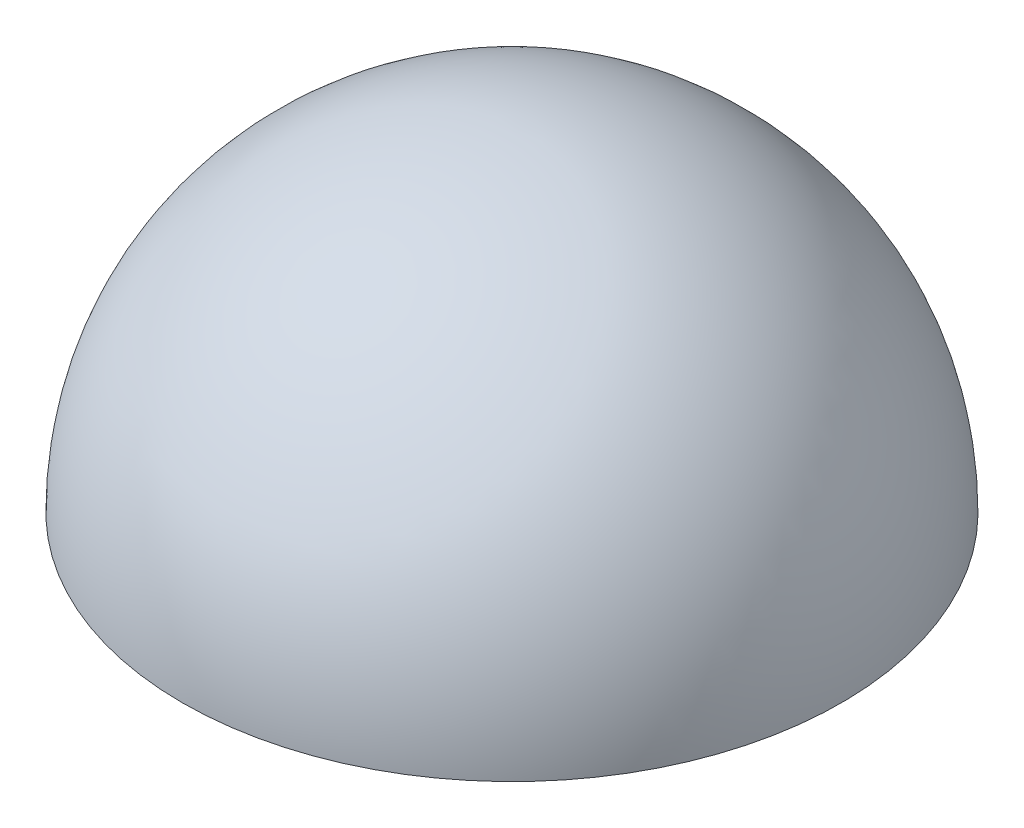
ISO-10303-21;
HEADER;
FILE_DESCRIPTION(('STEP AP214'),'2;1');
FILE_NAME('part.step','',(''),(''),'','','');
FILE_SCHEMA(('AUTOMOTIVE_DESIGN { 1 0 10303 214 1 1 1 1 }'));
ENDSEC;
DATA;
#1=APPLICATION_CONTEXT('core data for automotive mechanical design processes');
#2=APPLICATION_PROTOCOL_DEFINITION('international standard','automotive_design',2000,#1);
#3=PRODUCT_CONTEXT('',#1,'mechanical');
#4=PRODUCT('Part','Part','',(#3));
#5=PRODUCT_RELATED_PRODUCT_CATEGORY('part','',(#4));
#6=PRODUCT_DEFINITION_FORMATION('','',#4);
#7=PRODUCT_DEFINITION_CONTEXT('part definition',#1,'design');
#8=PRODUCT_DEFINITION('design','',#6,#7);
#9=PRODUCT_DEFINITION_SHAPE('','',#8);
#10=(LENGTH_UNIT() NAMED_UNIT(*) SI_UNIT(.MILLI.,.METRE.));
#11=(NAMED_UNIT(*) PLANE_ANGLE_UNIT() SI_UNIT($,.RADIAN.));
#12=(NAMED_UNIT(*) SI_UNIT($,.STERADIAN.) SOLID_ANGLE_UNIT());
#13=UNCERTAINTY_MEASURE_WITH_UNIT(LENGTH_MEASURE(1.E-05),#10,'distance_accuracy_value','');
#14=(GEOMETRIC_REPRESENTATION_CONTEXT(3) GLOBAL_UNCERTAINTY_ASSIGNED_CONTEXT((#13)) GLOBAL_UNIT_ASSIGNED_CONTEXT((#10,
#11,#12)) REPRESENTATION_CONTEXT('',''));
#15=CARTESIAN_POINT('',(0.,0.,0.));
#16=DIRECTION('',(0.,0.,1.));
#17=DIRECTION('',(1.,0.,0.));
#18=AXIS2_PLACEMENT_3D('',#15,#16,#17);
#19=CARTESIAN_POINT('',(0.,0.,0.));
#20=DIRECTION('',(0.,0.,-1.));
#21=DIRECTION('',(-1.,0.,0.));
#22=AXIS2_PLACEMENT_3D('',#19,#20,#21);
#23=SPHERICAL_SURFACE('',#22,25.25);
#24=CARTESIAN_POINT('',(0.,0.,0.));
#25=DIRECTION('',(0.,-1.,0.));
#26=DIRECTION('',(0.,0.,1.));
#27=AXIS2_PLACEMENT_3D('',#24,#25,#26);
#28=SPHERICAL_SURFACE('',#27,25.25);
#29=CARTESIAN_POINT('',(0.,0.,0.));
#30=DIRECTION('',(0.,-1.,0.));
#31=DIRECTION('',(0.,0.,1.));
#32=AXIS2_PLACEMENT_3D('',#29,#30,#31);
#33=CIRCLE('',#32,25.25);
#34=CARTESIAN_POINT('',(0.,0.,25.25));
#35=VERTEX_POINT('',#34);
#36=EDGE_CURVE('E11',#35,#35,#33,.T.);
#37=ORIENTED_EDGE('',*,*,#36,.F.);
#38=EDGE_LOOP('',(#37));
#39=FACE_BOUND('',#38,.T.);
#40=ADVANCED_FACE('F39',(#39),#28,.T.);
#41=CARTESIAN_POINT('',(0.,0.,0.));
#42=DIRECTION('',(0.,-1.,0.));
#43=DIRECTION('',(0.,0.,1.));
#44=AXIS2_PLACEMENT_3D('',#41,#42,#43);
#45=PLANE('',#44);
#46=CARTESIAN_POINT('',(0.,0.,0.));
#47=DIRECTION('',(0.,-1.,0.));
#48=DIRECTION('',(1.,0.,0.));
#49=AXIS2_PLACEMENT_3D('',#46,#47,#48);
#50=CIRCLE('',#49,24.825);
#51=CARTESIAN_POINT('',(-5.13443640124095,0.,24.2882314679684));
#52=VERTEX_POINT('',#51);
#53=CARTESIAN_POINT('',(-23.5585011040672,-1.64508133951932E-13,-7.82800426224105));
#54=VERTEX_POINT('',#53);
#55=EDGE_CURVE('E261',#52,#54,#50,.T.);
#56=ORIENTED_EDGE('',*,*,#55,.F.);
#57=DIRECTION('',(0.206825232678387,0.,-0.978377904047066));
#58=VECTOR('',#57,1.);
#59=CARTESIAN_POINT('',(-5.13443640124095,0.,24.2882314679684));
#60=LINE('',#59,#58);
#61=CARTESIAN_POINT('',(-5.,0.,23.6522858303378));
#62=VERTEX_POINT('',#61);
#63=EDGE_CURVE('E206',#52,#62,#60,.T.);
#64=ORIENTED_EDGE('',*,*,#63,.T.);
#65=CARTESIAN_POINT('',(0.,0.,0.));
#66=DIRECTION('',(0.,1.,0.));
#67=DIRECTION('',(1.,0.,0.));
#68=AXIS2_PLACEMENT_3D('',#65,#66,#67);
#69=CIRCLE('',#68,24.175);
#70=CARTESIAN_POINT('',(5.,0.,23.6522858303378));
#71=VERTEX_POINT('',#70);
#72=EDGE_CURVE('E236',#62,#71,#69,.T.);
#73=ORIENTED_EDGE('',*,*,#72,.T.);
#74=DIRECTION('',(0.,0.,1.));
#75=VECTOR('',#74,1.);
#76=CARTESIAN_POINT('',(5.,0.,23.6522858303378));
#77=LINE('',#76,#75);
#78=CARTESIAN_POINT('',(4.99999999999999,0.,24.3162625623265));
#79=VERTEX_POINT('',#78);
#80=EDGE_CURVE('E220',#71,#79,#77,.T.);
#81=ORIENTED_EDGE('',*,*,#80,.T.);
#82=CARTESIAN_POINT('',(23.6014436648777,1.64808000251356E-13,-7.69756337639399));
#83=VERTEX_POINT('',#82);
#84=EDGE_CURVE('E247',#83,#79,#50,.T.);
#85=ORIENTED_EDGE('',*,*,#84,.F.);
#86=DIRECTION('',(-0.950712735745326,0.,0.310073046380425));
#87=VECTOR('',#86,1.);
#88=CARTESIAN_POINT('',(23.6014436648777,1.64808000251356E-13,-7.69756337639399));
#89=LINE('',#88,#87);
#90=CARTESIAN_POINT('',(22.9834803866433,1.60492785743265E-13,-7.49601589624672));
#91=VERTEX_POINT('',#90);
#92=EDGE_CURVE('E170',#83,#91,#89,.T.);
#93=ORIENTED_EDGE('',*,*,#92,.T.);
#94=CARTESIAN_POINT('',(0.,0.,0.));
#95=DIRECTION('',(0.,1.,0.));
#96=DIRECTION('',(1.,0.,0.));
#97=AXIS2_PLACEMENT_3D('',#94,#95,#96);
#98=CIRCLE('',#97,24.175);
#99=CARTESIAN_POINT('',(17.9834803866433,1.25577972354833E-13,-16.1562699340911));
#100=VERTEX_POINT('',#99);
#101=EDGE_CURVE('E195',#91,#100,#98,.T.);
#102=ORIENTED_EDGE('',*,*,#101,.T.);
#103=DIRECTION('',(0.866025403784441,0.,-0.499999999999996));
#104=VECTOR('',#103,1.);
#105=CARTESIAN_POINT('',(17.9834803866433,1.25577972354834E-13,-16.1562699340911));
#106=LINE('',#105,#104);
#107=CARTESIAN_POINT('',(18.5585011040672,1.29593320563501E-13,-16.4882583000854));
#108=VERTEX_POINT('',#107);
#109=EDGE_CURVE('E179',#100,#108,#106,.T.);
#110=ORIENTED_EDGE('',*,*,#109,.T.);
#111=CARTESIAN_POINT('',(-18.4670072636368,-1.28954422490536E-13,-16.5906680915744));
#112=VERTEX_POINT('',#111);
#113=EDGE_CURVE('E263',#112,#108,#50,.T.);
#114=ORIENTED_EDGE('',*,*,#113,.F.);
#115=DIRECTION('',(0.743887503066944,0.,0.66830485766664));
#116=VECTOR('',#115,1.);
#117=CARTESIAN_POINT('',(-18.4670072636368,-1.28954422490536E-13,-16.5906680915744));
#118=LINE('',#117,#116);
#119=CARTESIAN_POINT('',(-17.9834803866433,-1.25577972354833E-13,-16.1562699340911));
#120=VERTEX_POINT('',#119);
#121=EDGE_CURVE('E160',#112,#120,#118,.T.);
#122=ORIENTED_EDGE('',*,*,#121,.T.);
#123=CARTESIAN_POINT('',(0.,0.,0.));
#124=DIRECTION('',(0.,1.,0.));
#125=DIRECTION('',(1.,0.,0.));
#126=AXIS2_PLACEMENT_3D('',#123,#124,#125);
#127=CIRCLE('',#126,24.175);
#128=CARTESIAN_POINT('',(-22.9834803866433,-1.60492785743264E-13,-7.49601589624673));
#129=VERTEX_POINT('',#128);
#130=EDGE_CURVE('E134',#120,#129,#127,.T.);
#131=ORIENTED_EDGE('',*,*,#130,.T.);
#132=DIRECTION('',(-0.86602540378444,0.,-0.499999999999997));
#133=VECTOR('',#132,1.);
#134=CARTESIAN_POINT('',(-22.9834803866433,-1.60492785743264E-13,-7.49601589624674));
#135=LINE('',#134,#133);
#136=EDGE_CURVE('E155',#129,#54,#135,.T.);
#137=ORIENTED_EDGE('',*,*,#136,.T.);
#138=EDGE_LOOP('',(#56,#64,#73,#81,#85,#93,#102,#110,#114,#122,#131,#137));
#139=FACE_BOUND('',#138,.T.);
#140=ORIENTED_EDGE('',*,*,#36,.T.);
#141=EDGE_LOOP('',(#140));
#142=FACE_BOUND('',#141,.T.);
#143=ADVANCED_FACE('F276',(#139,#142),#45,.T.);
#144=CARTESIAN_POINT('',(0.,2.15,0.));
#145=DIRECTION('',(0.,-1.,0.));
#146=DIRECTION('',(1.,0.,0.));
#147=AXIS2_PLACEMENT_3D('',#144,#145,#146);
#148=CYLINDRICAL_SURFACE('',#147,24.825);
#149=ORIENTED_EDGE('',*,*,#55,.T.);
#150=DIRECTION('',(0.,-1.,0.));
#151=VECTOR('',#150,1.);
#152=CARTESIAN_POINT('',(-23.5585011040672,1.04999999999984,-7.82800426224106));
#153=LINE('',#152,#151);
#154=CARTESIAN_POINT('',(-23.5585011040672,1.04999999999984,-7.82800426224105));
#155=VERTEX_POINT('',#154);
#156=EDGE_CURVE('E55',#155,#54,#153,.T.);
#157=ORIENTED_EDGE('',*,*,#156,.F.);
#158=CARTESIAN_POINT('',(0.,1.05,0.));
#159=DIRECTION('',(0.,-1.,0.));
#160=DIRECTION('',(1.,0.,0.));
#161=AXIS2_PLACEMENT_3D('',#158,#159,#160);
#162=CIRCLE('',#161,24.825);
#163=CARTESIAN_POINT('',(-18.4670072636368,1.04999999999987,-16.5906680915744));
#164=VERTEX_POINT('',#163);
#165=EDGE_CURVE('E59',#155,#164,#162,.T.);
#166=ORIENTED_EDGE('',*,*,#165,.T.);
#167=DIRECTION('',(0.,-1.,0.));
#168=VECTOR('',#167,1.);
#169=CARTESIAN_POINT('',(-18.4670072636368,1.04999999999987,-16.5906680915744));
#170=LINE('',#169,#168);
#171=EDGE_CURVE('E141',#164,#112,#170,.T.);
#172=ORIENTED_EDGE('',*,*,#171,.T.);
#173=ORIENTED_EDGE('',*,*,#113,.T.);
#174=DIRECTION('',(0.,-1.,0.));
#175=VECTOR('',#174,1.);
#176=CARTESIAN_POINT('',(18.5585011040672,1.05000000000013,-16.4882583000854));
#177=LINE('',#176,#175);
#178=CARTESIAN_POINT('',(18.5585011040672,1.05000000000013,-16.4882583000854));
#179=VERTEX_POINT('',#178);
#180=EDGE_CURVE('E202',#179,#108,#177,.T.);
#181=ORIENTED_EDGE('',*,*,#180,.F.);
#182=CARTESIAN_POINT('',(0.,1.05,0.));
#183=DIRECTION('',(0.,-1.,0.));
#184=DIRECTION('',(1.,0.,0.));
#185=AXIS2_PLACEMENT_3D('',#182,#183,#184);
#186=CIRCLE('',#185,24.825);
#187=CARTESIAN_POINT('',(23.6014436648777,1.05000000000017,-7.69756337639399));
#188=VERTEX_POINT('',#187);
#189=EDGE_CURVE('E175',#179,#188,#186,.T.);
#190=ORIENTED_EDGE('',*,*,#189,.T.);
#191=DIRECTION('',(0.,-1.,0.));
#192=VECTOR('',#191,1.);
#193=CARTESIAN_POINT('',(23.6014436648777,1.05000000000017,-7.69756337639399));
#194=LINE('',#193,#192);
#195=EDGE_CURVE('E191',#188,#83,#194,.T.);
#196=ORIENTED_EDGE('',*,*,#195,.T.);
#197=ORIENTED_EDGE('',*,*,#84,.T.);
#198=DIRECTION('',(0.,-1.,0.));
#199=VECTOR('',#198,1.);
#200=CARTESIAN_POINT('',(4.99999999999999,1.05000000000004,24.3162625623265));
#201=LINE('',#200,#199);
#202=CARTESIAN_POINT('',(4.99999999999999,1.05000000000004,24.3162625623265));
#203=VERTEX_POINT('',#202);
#204=EDGE_CURVE('E243',#203,#79,#201,.T.);
#205=ORIENTED_EDGE('',*,*,#204,.F.);
#206=CARTESIAN_POINT('',(0.,1.05,0.));
#207=DIRECTION('',(0.,-1.,0.));
#208=DIRECTION('',(1.,0.,0.));
#209=AXIS2_PLACEMENT_3D('',#206,#207,#208);
#210=CIRCLE('',#209,24.825);
#211=CARTESIAN_POINT('',(-5.13443640124096,1.04999999999996,24.2882314679684));
#212=VERTEX_POINT('',#211);
#213=EDGE_CURVE('E216',#203,#212,#210,.T.);
#214=ORIENTED_EDGE('',*,*,#213,.T.);
#215=DIRECTION('',(0.,-1.,0.));
#216=VECTOR('',#215,1.);
#217=CARTESIAN_POINT('',(-5.13443640124096,1.04999999999996,24.2882314679684));
#218=LINE('',#217,#216);
#219=EDGE_CURVE('E232',#212,#52,#218,.T.);
#220=ORIENTED_EDGE('',*,*,#219,.T.);
#221=EDGE_LOOP('',(#149,#157,#166,#172,#173,#181,#190,#196,#197,#205,#214,#220));
#222=FACE_BOUND('',#221,.T.);
#223=CARTESIAN_POINT('',(0.,2.15,0.));
#224=DIRECTION('',(0.,-1.,0.));
#225=DIRECTION('',(1.,0.,0.));
#226=AXIS2_PLACEMENT_3D('',#223,#224,#225);
#227=CIRCLE('',#226,24.825);
#228=CARTESIAN_POINT('',(24.825,2.15000000000017,0.));
#229=VERTEX_POINT('',#228);
#230=EDGE_CURVE('E257',#229,#229,#227,.T.);
#231=ORIENTED_EDGE('',*,*,#230,.F.);
#232=EDGE_LOOP('',(#231));
#233=FACE_BOUND('',#232,.T.);
#234=ADVANCED_FACE('F266',(#222,#233),#148,.F.);
#235=CARTESIAN_POINT('',(0.,2.15,0.));
#236=DIRECTION('',(0.,-1.,0.));
#237=DIRECTION('',(1.,0.,0.));
#238=AXIS2_PLACEMENT_3D('',#235,#236,#237);
#239=PLANE('',#238);
#240=CARTESIAN_POINT('',(0.,2.15,0.));
#241=DIRECTION('',(0.,-1.,0.));
#242=DIRECTION('',(1.,0.,0.));
#243=AXIS2_PLACEMENT_3D('',#240,#241,#242);
#244=CIRCLE('',#243,23.1503779666769);
#245=CARTESIAN_POINT('',(23.1503779666769,2.15000000000016,0.));
#246=VERTEX_POINT('',#245);
#247=EDGE_CURVE('E43',#246,#246,#244,.T.);
#248=ORIENTED_EDGE('',*,*,#247,.F.);
#249=EDGE_LOOP('',(#248));
#250=FACE_BOUND('',#249,.T.);
#251=ORIENTED_EDGE('',*,*,#230,.T.);
#252=EDGE_LOOP('',(#251));
#253=FACE_BOUND('',#252,.T.);
#254=ADVANCED_FACE('F308',(#250,#253),#239,.T.);
#255=CARTESIAN_POINT('',(0.,0.,0.));
#256=DIRECTION('',(0.,0.,-1.));
#257=DIRECTION('',(-1.,0.,0.));
#258=AXIS2_PLACEMENT_3D('',#255,#256,#257);
#259=SPHERICAL_SURFACE('',#258,23.25);
#260=CARTESIAN_POINT('',(0.,0.,0.));
#261=DIRECTION('',(0.,-1.,0.));
#262=DIRECTION('',(1.,0.,0.));
#263=AXIS2_PLACEMENT_3D('',#260,#261,#262);
#264=SPHERICAL_SURFACE('',#263,23.25);
#265=ORIENTED_EDGE('',*,*,#247,.T.);
#266=EDGE_LOOP('',(#265));
#267=FACE_BOUND('',#266,.T.);
#268=ADVANCED_FACE('F41',(#267),#264,.F.);
#269=CARTESIAN_POINT('',(4.99999999999999,1.05000000000004,23.6522858303378));
#270=DIRECTION('',(1.,0.,0.));
#271=DIRECTION('',(0.,1.,0.));
#272=AXIS2_PLACEMENT_3D('',#269,#270,#271);
#273=PLANE('',#272);
#274=ORIENTED_EDGE('',*,*,#80,.F.);
#275=DIRECTION('',(0.,-1.,0.));
#276=VECTOR('',#275,1.);
#277=CARTESIAN_POINT('',(4.99999999999999,1.05000000000004,23.6522858303378));
#278=LINE('',#277,#276);
#279=CARTESIAN_POINT('',(4.99999999999999,1.05000000000004,23.6522858303378));
#280=VERTEX_POINT('',#279);
#281=EDGE_CURVE('E248',#280,#71,#278,.T.);
#282=ORIENTED_EDGE('',*,*,#281,.F.);
#283=DIRECTION('',(0.,0.,1.));
#284=VECTOR('',#283,1.);
#285=CARTESIAN_POINT('',(4.99999999999999,1.05000000000004,23.6522858303378));
#286=LINE('',#285,#284);
#287=EDGE_CURVE('E228',#280,#203,#286,.T.);
#288=ORIENTED_EDGE('',*,*,#287,.T.);
#289=ORIENTED_EDGE('',*,*,#204,.T.);
#290=EDGE_LOOP('',(#274,#282,#288,#289));
#291=FACE_BOUND('',#290,.T.);
#292=ADVANCED_FACE('F274',(#291),#273,.T.);
#293=CARTESIAN_POINT('',(0.,1.05,0.));
#294=DIRECTION('',(0.,-1.,0.));
#295=DIRECTION('',(1.,0.,0.));
#296=AXIS2_PLACEMENT_3D('',#293,#294,#295);
#297=CYLINDRICAL_SURFACE('',#296,24.175);
#298=ORIENTED_EDGE('',*,*,#72,.F.);
#299=DIRECTION('',(0.,-1.,0.));
#300=VECTOR('',#299,1.);
#301=CARTESIAN_POINT('',(-5.00000000000001,1.04999999999997,23.6522858303378));
#302=LINE('',#301,#300);
#303=CARTESIAN_POINT('',(-5.00000000000001,1.04999999999997,23.6522858303378));
#304=VERTEX_POINT('',#303);
#305=EDGE_CURVE('E251',#304,#62,#302,.T.);
#306=ORIENTED_EDGE('',*,*,#305,.F.);
#307=CARTESIAN_POINT('',(0.,1.05,0.));
#308=DIRECTION('',(0.,1.,0.));
#309=DIRECTION('',(1.,0.,0.));
#310=AXIS2_PLACEMENT_3D('',#307,#308,#309);
#311=CIRCLE('',#310,24.175);
#312=EDGE_CURVE('E224',#304,#280,#311,.T.);
#313=ORIENTED_EDGE('',*,*,#312,.T.);
#314=ORIENTED_EDGE('',*,*,#281,.T.);
#315=EDGE_LOOP('',(#298,#306,#313,#314));
#316=FACE_BOUND('',#315,.T.);
#317=ADVANCED_FACE('F281',(#316),#297,.F.);
#318=CARTESIAN_POINT('',(-5.13443640124096,1.04999999999996,24.2882314679684));
#319=DIRECTION('',(-0.978377904047067,0.,-0.206825232678387));
#320=DIRECTION('',(-0.206825232678387,0.,0.978377904047067));
#321=AXIS2_PLACEMENT_3D('',#318,#319,#320);
#322=PLANE('',#321);
#323=ORIENTED_EDGE('',*,*,#63,.F.);
#324=ORIENTED_EDGE('',*,*,#219,.F.);
#325=DIRECTION('',(0.206825232678387,0.,-0.978377904047066));
#326=VECTOR('',#325,1.);
#327=CARTESIAN_POINT('',(-5.13443640124096,1.04999999999996,24.2882314679684));
#328=LINE('',#327,#326);
#329=EDGE_CURVE('E219',#212,#304,#328,.T.);
#330=ORIENTED_EDGE('',*,*,#329,.T.);
#331=ORIENTED_EDGE('',*,*,#305,.T.);
#332=EDGE_LOOP('',(#323,#324,#330,#331));
#333=FACE_BOUND('',#332,.T.);
#334=ADVANCED_FACE('F288',(#333),#322,.T.);
#335=CARTESIAN_POINT('',(0.,1.05,0.));
#336=DIRECTION('',(0.,-1.,0.));
#337=DIRECTION('',(1.,0.,0.));
#338=AXIS2_PLACEMENT_3D('',#335,#336,#337);
#339=PLANE('',#338);
#340=ORIENTED_EDGE('',*,*,#213,.F.);
#341=ORIENTED_EDGE('',*,*,#287,.F.);
#342=ORIENTED_EDGE('',*,*,#312,.F.);
#343=ORIENTED_EDGE('',*,*,#329,.F.);
#344=EDGE_LOOP('',(#340,#341,#342,#343));
#345=FACE_BOUND('',#344,.T.);
#346=ADVANCED_FACE('F285',(#345),#339,.F.);
#347=CARTESIAN_POINT('',(17.9834803866433,1.05000000000013,-16.1562699340911));
#348=DIRECTION('',(-0.499999999999996,0.,-0.866025403784441));
#349=DIRECTION('',(-0.866025403784441,0.,0.499999999999996));
#350=AXIS2_PLACEMENT_3D('',#347,#348,#349);
#351=PLANE('',#350);
#352=ORIENTED_EDGE('',*,*,#109,.F.);
#353=DIRECTION('',(0.,-1.,0.));
#354=VECTOR('',#353,1.);
#355=CARTESIAN_POINT('',(17.9834803866433,1.05000000000013,-16.1562699340911));
#356=LINE('',#355,#354);
#357=CARTESIAN_POINT('',(17.9834803866433,1.05000000000013,-16.1562699340911));
#358=VERTEX_POINT('',#357);
#359=EDGE_CURVE('E207',#358,#100,#356,.T.);
#360=ORIENTED_EDGE('',*,*,#359,.F.);
#361=DIRECTION('',(0.866025403784441,0.,-0.499999999999996));
#362=VECTOR('',#361,1.);
#363=CARTESIAN_POINT('',(17.9834803866433,1.05000000000013,-16.1562699340911));
#364=LINE('',#363,#362);
#365=EDGE_CURVE('E187',#358,#179,#364,.T.);
#366=ORIENTED_EDGE('',*,*,#365,.T.);
#367=ORIENTED_EDGE('',*,*,#180,.T.);
#368=EDGE_LOOP('',(#352,#360,#366,#367));
#369=FACE_BOUND('',#368,.T.);
#370=ADVANCED_FACE('F295',(#369),#351,.T.);
#371=CARTESIAN_POINT('',(0.,1.05,0.));
#372=DIRECTION('',(0.,-1.,0.));
#373=DIRECTION('',(1.,0.,0.));
#374=AXIS2_PLACEMENT_3D('',#371,#372,#373);
#375=CYLINDRICAL_SURFACE('',#374,24.175);
#376=ORIENTED_EDGE('',*,*,#101,.F.);
#377=DIRECTION('',(0.,-1.,0.));
#378=VECTOR('',#377,1.);
#379=CARTESIAN_POINT('',(22.9834803866433,1.05000000000016,-7.49601589624672));
#380=LINE('',#379,#378);
#381=CARTESIAN_POINT('',(22.9834803866433,1.05000000000016,-7.49601589624672));
#382=VERTEX_POINT('',#381);
#383=EDGE_CURVE('E210',#382,#91,#380,.T.);
#384=ORIENTED_EDGE('',*,*,#383,.F.);
#385=CARTESIAN_POINT('',(0.,1.05,0.));
#386=DIRECTION('',(0.,1.,0.));
#387=DIRECTION('',(1.,0.,0.));
#388=AXIS2_PLACEMENT_3D('',#385,#386,#387);
#389=CIRCLE('',#388,24.175);
#390=EDGE_CURVE('E183',#382,#358,#389,.T.);
#391=ORIENTED_EDGE('',*,*,#390,.T.);
#392=ORIENTED_EDGE('',*,*,#359,.T.);
#393=EDGE_LOOP('',(#376,#384,#391,#392));
#394=FACE_BOUND('',#393,.T.);
#395=ADVANCED_FACE('F331',(#394),#375,.F.);
#396=CARTESIAN_POINT('',(23.6014436648777,1.05000000000017,-7.69756337639399));
#397=DIRECTION('',(0.310073046380425,0.,0.950712735745326));
#398=DIRECTION('',(0.950712735745326,0.,-0.310073046380425));
#399=AXIS2_PLACEMENT_3D('',#396,#397,#398);
#400=PLANE('',#399);
#401=ORIENTED_EDGE('',*,*,#92,.F.);
#402=ORIENTED_EDGE('',*,*,#195,.F.);
#403=DIRECTION('',(-0.950712735745326,0.,0.310073046380425));
#404=VECTOR('',#403,1.);
#405=CARTESIAN_POINT('',(23.6014436648777,1.05000000000017,-7.69756337639399));
#406=LINE('',#405,#404);
#407=EDGE_CURVE('E178',#188,#382,#406,.T.);
#408=ORIENTED_EDGE('',*,*,#407,.T.);
#409=ORIENTED_EDGE('',*,*,#383,.T.);
#410=EDGE_LOOP('',(#401,#402,#408,#409));
#411=FACE_BOUND('',#410,.T.);
#412=ADVANCED_FACE('F327',(#411),#400,.T.);
#413=CARTESIAN_POINT('',(0.,1.05,0.));
#414=DIRECTION('',(0.,-1.,0.));
#415=DIRECTION('',(1.,0.,0.));
#416=AXIS2_PLACEMENT_3D('',#413,#414,#415);
#417=PLANE('',#416);
#418=ORIENTED_EDGE('',*,*,#189,.F.);
#419=ORIENTED_EDGE('',*,*,#365,.F.);
#420=ORIENTED_EDGE('',*,*,#390,.F.);
#421=ORIENTED_EDGE('',*,*,#407,.F.);
#422=EDGE_LOOP('',(#418,#419,#420,#421));
#423=FACE_BOUND('',#422,.T.);
#424=ADVANCED_FACE('F330',(#423),#417,.F.);
#425=CARTESIAN_POINT('',(-22.9834803866433,1.04999999999984,-7.49601589624674));
#426=DIRECTION('',(-0.499999999999998,0.,0.86602540378444));
#427=DIRECTION('',(0.86602540378444,0.,0.499999999999998));
#428=AXIS2_PLACEMENT_3D('',#425,#426,#427);
#429=PLANE('',#428);
#430=ORIENTED_EDGE('',*,*,#136,.F.);
#431=DIRECTION('',(0.,-1.,0.));
#432=VECTOR('',#431,1.);
#433=CARTESIAN_POINT('',(-22.9834803866433,1.04999999999984,-7.49601589624673));
#434=LINE('',#433,#432);
#435=CARTESIAN_POINT('',(-22.9834803866433,1.04999999999984,-7.49601589624673));
#436=VERTEX_POINT('',#435);
#437=EDGE_CURVE('E140',#436,#129,#434,.T.);
#438=ORIENTED_EDGE('',*,*,#437,.F.);
#439=DIRECTION('',(-0.86602540378444,0.,-0.499999999999997));
#440=VECTOR('',#439,1.);
#441=CARTESIAN_POINT('',(-22.9834803866433,1.04999999999984,-7.49601589624674));
#442=LINE('',#441,#440);
#443=EDGE_CURVE('E148',#436,#155,#442,.T.);
#444=ORIENTED_EDGE('',*,*,#443,.T.);
#445=ORIENTED_EDGE('',*,*,#156,.T.);
#446=EDGE_LOOP('',(#430,#438,#444,#445));
#447=FACE_BOUND('',#446,.T.);
#448=ADVANCED_FACE('F341',(#447),#429,.T.);
#449=CARTESIAN_POINT('',(0.,1.05,0.));
#450=DIRECTION('',(0.,-1.,0.));
#451=DIRECTION('',(1.,0.,0.));
#452=AXIS2_PLACEMENT_3D('',#449,#450,#451);
#453=CYLINDRICAL_SURFACE('',#452,24.175);
#454=ORIENTED_EDGE('',*,*,#130,.F.);
#455=DIRECTION('',(0.,-1.,0.));
#456=VECTOR('',#455,1.);
#457=CARTESIAN_POINT('',(-17.9834803866433,1.04999999999987,-16.1562699340911));
#458=LINE('',#457,#456);
#459=CARTESIAN_POINT('',(-17.9834803866433,1.04999999999987,-16.1562699340911));
#460=VERTEX_POINT('',#459);
#461=EDGE_CURVE('E128',#460,#120,#458,.T.);
#462=ORIENTED_EDGE('',*,*,#461,.F.);
#463=CARTESIAN_POINT('',(0.,1.05,0.));
#464=DIRECTION('',(0.,1.,0.));
#465=DIRECTION('',(1.,0.,0.));
#466=AXIS2_PLACEMENT_3D('',#463,#464,#465);
#467=CIRCLE('',#466,24.175);
#468=EDGE_CURVE('E131',#460,#436,#467,.T.);
#469=ORIENTED_EDGE('',*,*,#468,.T.);
#470=ORIENTED_EDGE('',*,*,#437,.T.);
#471=EDGE_LOOP('',(#454,#462,#469,#470));
#472=FACE_BOUND('',#471,.T.);
#473=ADVANCED_FACE('F130',(#472),#453,.F.);
#474=CARTESIAN_POINT('',(-18.4670072636368,1.04999999999987,-16.5906680915744));
#475=DIRECTION('',(0.66830485766664,0.,-0.743887503066944));
#476=DIRECTION('',(-0.743887503066944,0.,-0.66830485766664));
#477=AXIS2_PLACEMENT_3D('',#474,#475,#476);
#478=PLANE('',#477);
#479=ORIENTED_EDGE('',*,*,#121,.F.);
#480=ORIENTED_EDGE('',*,*,#171,.F.);
#481=DIRECTION('',(0.743887503066944,0.,0.66830485766664));
#482=VECTOR('',#481,1.);
#483=CARTESIAN_POINT('',(-18.4670072636368,1.04999999999987,-16.5906680915744));
#484=LINE('',#483,#482);
#485=EDGE_CURVE('E146',#164,#460,#484,.T.);
#486=ORIENTED_EDGE('',*,*,#485,.T.);
#487=ORIENTED_EDGE('',*,*,#461,.T.);
#488=EDGE_LOOP('',(#479,#480,#486,#487));
#489=FACE_BOUND('',#488,.T.);
#490=ADVANCED_FACE('F151',(#489),#478,.T.);
#491=CARTESIAN_POINT('',(0.,1.05,0.));
#492=DIRECTION('',(0.,-1.,0.));
#493=DIRECTION('',(1.,0.,0.));
#494=AXIS2_PLACEMENT_3D('',#491,#492,#493);
#495=PLANE('',#494);
#496=ORIENTED_EDGE('',*,*,#165,.F.);
#497=ORIENTED_EDGE('',*,*,#443,.F.);
#498=ORIENTED_EDGE('',*,*,#468,.F.);
#499=ORIENTED_EDGE('',*,*,#485,.F.);
#500=EDGE_LOOP('',(#496,#497,#498,#499));
#501=FACE_BOUND('',#500,.T.);
#502=ADVANCED_FACE('F145',(#501),#495,.F.);
#503=CLOSED_SHELL('',(#40,#143,#234,#254,#268,#292,#317,#334,#346,#370,#395,#412,#424,#448,#473,
#490,#502));
#504=MANIFOLD_SOLID_BREP('B2',#503);
#505=ADVANCED_BREP_SHAPE_REPRESENTATION('',(#18,#504),#14);
#506=SHAPE_DEFINITION_REPRESENTATION(#9,#505);
ENDSEC;
END-ISO-10303-21;
